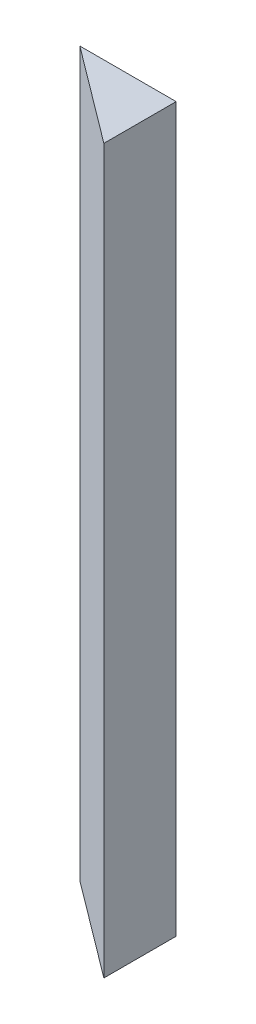
ISO-10303-21;
HEADER;
FILE_DESCRIPTION(('STEP AP214'),'2;1');
FILE_NAME('part.step','',(''),(''),'','','');
FILE_SCHEMA(('AUTOMOTIVE_DESIGN { 1 0 10303 214 1 1 1 1 }'));
ENDSEC;
DATA;
#1=APPLICATION_CONTEXT('core data for automotive mechanical design processes');
#2=APPLICATION_PROTOCOL_DEFINITION('international standard','automotive_design',2000,#1);
#3=PRODUCT_CONTEXT('',#1,'mechanical');
#4=PRODUCT('Part','Part','',(#3));
#5=PRODUCT_RELATED_PRODUCT_CATEGORY('part','',(#4));
#6=PRODUCT_DEFINITION_FORMATION('','',#4);
#7=PRODUCT_DEFINITION_CONTEXT('part definition',#1,'design');
#8=PRODUCT_DEFINITION('design','',#6,#7);
#9=PRODUCT_DEFINITION_SHAPE('','',#8);
#10=(LENGTH_UNIT() NAMED_UNIT(*) SI_UNIT(.MILLI.,.METRE.));
#11=(NAMED_UNIT(*) PLANE_ANGLE_UNIT() SI_UNIT($,.RADIAN.));
#12=(NAMED_UNIT(*) SI_UNIT($,.STERADIAN.) SOLID_ANGLE_UNIT());
#13=UNCERTAINTY_MEASURE_WITH_UNIT(LENGTH_MEASURE(1.E-05),#10,'distance_accuracy_value','');
#14=(GEOMETRIC_REPRESENTATION_CONTEXT(3) GLOBAL_UNCERTAINTY_ASSIGNED_CONTEXT((#13)) GLOBAL_UNIT_ASSIGNED_CONTEXT((#10,
#11,#12)) REPRESENTATION_CONTEXT('',''));
#15=CARTESIAN_POINT('',(0.,0.,0.));
#16=DIRECTION('',(0.,0.,1.));
#17=DIRECTION('',(1.,0.,0.));
#18=AXIS2_PLACEMENT_3D('',#15,#16,#17);
#19=CARTESIAN_POINT('',(3.906661108733,-0.750000296654108,-2.35778269529518));
#20=DIRECTION('',(0.,1.,8.74227765734759E-08));
#21=DIRECTION('',(-1.,0.,0.));
#22=AXIS2_PLACEMENT_3D('',#19,#20,#21);
#23=PLANE('',#22);
#24=DIRECTION('',(0.799759704949036,-5.24816640793063E-08,0.600320259811234));
#25=VECTOR('',#24,1.);
#26=CARTESIAN_POINT('',(3.766777825356,-0.75000029723644,-2.35112158656318));
#27=LINE('',#26,#25);
#28=CARTESIAN_POINT('',(3.766777825356,-0.75000029723844,-2.35112158656318));
#29=VERTEX_POINT('',#28);
#30=CARTESIAN_POINT('',(3.9,-0.750000305980718,-2.25112158656318));
#31=VERTEX_POINT('',#30);
#32=EDGE_CURVE('E11',#29,#31,#27,.T.);
#33=ORIENTED_EDGE('',*,*,#32,.T.);
#34=DIRECTION('',(0.,8.74227767955201E-08,-0.999999999999996));
#35=VECTOR('',#34,1.);
#36=CARTESIAN_POINT('',(3.9,-0.750000305978718,-2.25112158656318));
#37=LINE('',#36,#35);
#38=CARTESIAN_POINT('',(3.9,-0.75000029723844,-2.35112158656318));
#39=VERTEX_POINT('',#38);
#40=EDGE_CURVE('E49',#31,#39,#37,.T.);
#41=ORIENTED_EDGE('',*,*,#40,.T.);
#42=DIRECTION('',(-1.,0.,0.));
#43=VECTOR('',#42,1.);
#44=CARTESIAN_POINT('',(3.9,-0.75000029723644,-2.35112158656318));
#45=LINE('',#44,#43);
#46=EDGE_CURVE('E47',#39,#29,#45,.T.);
#47=ORIENTED_EDGE('',*,*,#46,.T.);
#48=EDGE_LOOP('',(#33,#41,#47));
#49=FACE_BOUND('',#48,.T.);
#50=ADVANCED_FACE('F17',(#49),#23,.T.);
#51=CARTESIAN_POINT('',(3.906661108733,-1.75000029665511,-2.35778278271795));
#52=DIRECTION('',(0.,1.,8.74227765734759E-08));
#53=DIRECTION('',(-1.,0.,0.));
#54=AXIS2_PLACEMENT_3D('',#51,#52,#53);
#55=PLANE('',#54);
#56=DIRECTION('',(-1.,0.,0.));
#57=VECTOR('',#56,1.);
#58=CARTESIAN_POINT('',(3.9,-1.75000029723744,-2.35112167398595));
#59=LINE('',#58,#57);
#60=CARTESIAN_POINT('',(3.9,-1.75000029723644,-2.35112167398595));
#61=VERTEX_POINT('',#60);
#62=CARTESIAN_POINT('',(3.766777825356,-1.75000029723644,-2.35112167398595));
#63=VERTEX_POINT('',#62);
#64=EDGE_CURVE('E24',#61,#63,#59,.T.);
#65=ORIENTED_EDGE('',*,*,#64,.F.);
#66=DIRECTION('',(0.,8.74227756852974E-08,-0.999999999999996));
#67=VECTOR('',#66,1.);
#68=CARTESIAN_POINT('',(3.9,-1.75000030597972,-2.25112167398595));
#69=LINE('',#68,#67);
#70=CARTESIAN_POINT('',(3.9,-1.75000030597872,-2.25112167398595));
#71=VERTEX_POINT('',#70);
#72=EDGE_CURVE('E53',#71,#61,#69,.T.);
#73=ORIENTED_EDGE('',*,*,#72,.F.);
#74=DIRECTION('',(0.799759704949036,-5.24816634128169E-08,0.600320259811234));
#75=VECTOR('',#74,1.);
#76=CARTESIAN_POINT('',(3.766777825356,-1.75000029723744,-2.35112167398595));
#77=LINE('',#76,#75);
#78=EDGE_CURVE('E68',#63,#71,#77,.T.);
#79=ORIENTED_EDGE('',*,*,#78,.F.);
#80=EDGE_LOOP('',(#65,#73,#79));
#81=FACE_BOUND('',#80,.T.);
#82=ADVANCED_FACE('F73',(#81),#55,.F.);
#83=CARTESIAN_POINT('',(3.766777825356,-0.75000029723644,-2.35112158656318));
#84=DIRECTION('',(0.600320259811235,6.99172139982287E-08,-0.799759704949038));
#85=DIRECTION('',(0.799759704949038,-5.24816639460086E-08,0.600320259811235));
#86=AXIS2_PLACEMENT_3D('',#83,#84,#85);
#87=PLANE('',#86);
#88=DIRECTION('',(0.,-0.999999999999996,-8.74227765733881E-08));
#89=VECTOR('',#88,1.);
#90=CARTESIAN_POINT('',(3.766777825356,-0.75000029723644,-2.35112158656318));
#91=LINE('',#90,#89);
#92=EDGE_CURVE('E59',#29,#63,#91,.T.);
#93=ORIENTED_EDGE('',*,*,#92,.T.);
#94=ORIENTED_EDGE('',*,*,#78,.T.);
#95=DIRECTION('',(0.,-0.999999999999996,-8.74227765733881E-08));
#96=VECTOR('',#95,1.);
#97=CARTESIAN_POINT('',(3.9,-0.750000305978718,-2.25112158656318));
#98=LINE('',#97,#96);
#99=EDGE_CURVE('E54',#31,#71,#98,.T.);
#100=ORIENTED_EDGE('',*,*,#99,.F.);
#101=ORIENTED_EDGE('',*,*,#32,.F.);
#102=EDGE_LOOP('',(#93,#94,#100,#101));
#103=FACE_BOUND('',#102,.T.);
#104=ADVANCED_FACE('F57',(#103),#87,.F.);
#105=CARTESIAN_POINT('',(3.9,-0.750000305978718,-2.25112158656318));
#106=DIRECTION('',(-1.,0.,0.));
#107=DIRECTION('',(0.,8.74227765734759E-08,-1.));
#108=AXIS2_PLACEMENT_3D('',#105,#106,#107);
#109=PLANE('',#108);
#110=ORIENTED_EDGE('',*,*,#99,.T.);
#111=ORIENTED_EDGE('',*,*,#72,.T.);
#112=DIRECTION('',(0.,-0.999999999999996,-8.74227765733881E-08));
#113=VECTOR('',#112,1.);
#114=CARTESIAN_POINT('',(3.9,-0.75000029723644,-2.35112158656318));
#115=LINE('',#114,#113);
#116=EDGE_CURVE('E70',#39,#61,#115,.T.);
#117=ORIENTED_EDGE('',*,*,#116,.F.);
#118=ORIENTED_EDGE('',*,*,#40,.F.);
#119=EDGE_LOOP('',(#110,#111,#117,#118));
#120=FACE_BOUND('',#119,.T.);
#121=ADVANCED_FACE('F72',(#120),#109,.F.);
#122=CARTESIAN_POINT('',(3.9,-0.75000029723644,-2.35112158656318));
#123=DIRECTION('',(0.,-8.74227765734759E-08,1.));
#124=DIRECTION('',(-1.,0.,0.));
#125=AXIS2_PLACEMENT_3D('',#122,#123,#124);
#126=PLANE('',#125);
#127=ORIENTED_EDGE('',*,*,#116,.T.);
#128=ORIENTED_EDGE('',*,*,#64,.T.);
#129=ORIENTED_EDGE('',*,*,#92,.F.);
#130=ORIENTED_EDGE('',*,*,#46,.F.);
#131=EDGE_LOOP('',(#127,#128,#129,#130));
#132=FACE_BOUND('',#131,.T.);
#133=ADVANCED_FACE('F61',(#132),#126,.F.);
#134=CLOSED_SHELL('',(#50,#82,#104,#121,#133));
#135=MANIFOLD_SOLID_BREP('B1',#134);
#136=ADVANCED_BREP_SHAPE_REPRESENTATION('',(#18,#135),#14);
#137=SHAPE_DEFINITION_REPRESENTATION(#9,#136);
ENDSEC;
END-ISO-10303-21;
